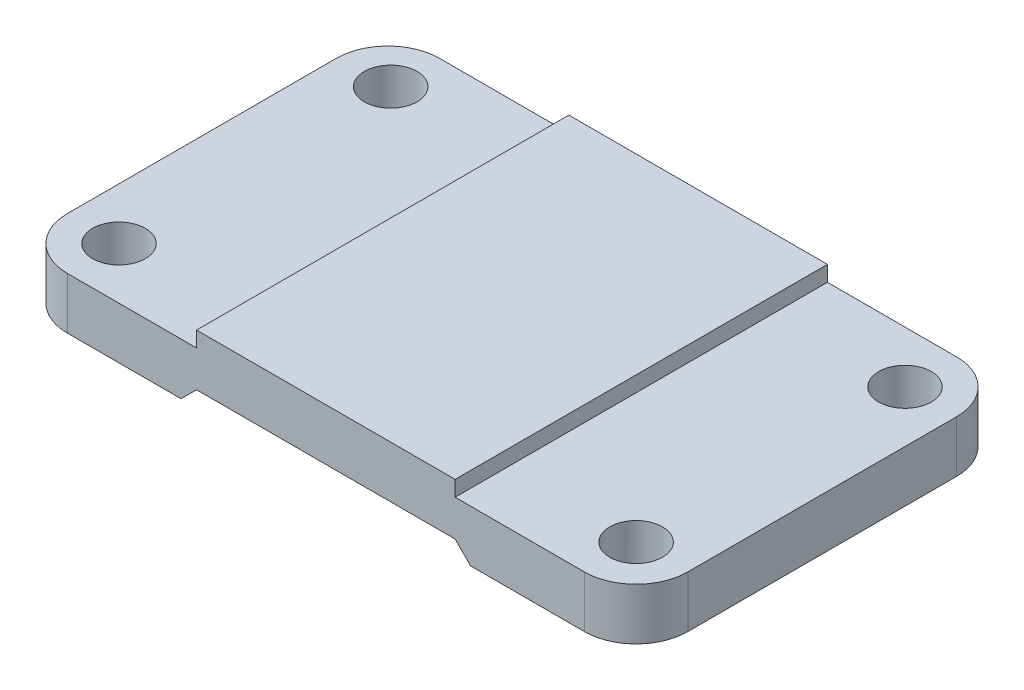
ISO-10303-21;
HEADER;
FILE_DESCRIPTION(('STEP AP214'),'2;1');
FILE_NAME('part.step','',(''),(''),'','','');
FILE_SCHEMA(('AUTOMOTIVE_DESIGN { 1 0 10303 214 1 1 1 1 }'));
ENDSEC;
DATA;
#1=APPLICATION_CONTEXT('core data for automotive mechanical design processes');
#2=APPLICATION_PROTOCOL_DEFINITION('international standard','automotive_design',2000,#1);
#3=PRODUCT_CONTEXT('',#1,'mechanical');
#4=PRODUCT('Part','Part','',(#3));
#5=PRODUCT_RELATED_PRODUCT_CATEGORY('part','',(#4));
#6=PRODUCT_DEFINITION_FORMATION('','',#4);
#7=PRODUCT_DEFINITION_CONTEXT('part definition',#1,'design');
#8=PRODUCT_DEFINITION('design','',#6,#7);
#9=PRODUCT_DEFINITION_SHAPE('','',#8);
#10=(LENGTH_UNIT() NAMED_UNIT(*) SI_UNIT(.MILLI.,.METRE.));
#11=(NAMED_UNIT(*) PLANE_ANGLE_UNIT() SI_UNIT($,.RADIAN.));
#12=(NAMED_UNIT(*) SI_UNIT($,.STERADIAN.) SOLID_ANGLE_UNIT());
#13=UNCERTAINTY_MEASURE_WITH_UNIT(LENGTH_MEASURE(1.E-05),#10,'distance_accuracy_value','');
#14=(GEOMETRIC_REPRESENTATION_CONTEXT(3) GLOBAL_UNCERTAINTY_ASSIGNED_CONTEXT((#13)) GLOBAL_UNIT_ASSIGNED_CONTEXT((#10,
#11,#12)) REPRESENTATION_CONTEXT('',''));
#15=CARTESIAN_POINT('',(0.,0.,0.));
#16=DIRECTION('',(0.,0.,1.));
#17=DIRECTION('',(1.,0.,0.));
#18=AXIS2_PLACEMENT_3D('',#15,#16,#17);
#19=CARTESIAN_POINT('',(0.,0.,0.));
#20=DIRECTION('',(0.,-1.,0.));
#21=DIRECTION('',(0.,0.,-1.));
#22=AXIS2_PLACEMENT_3D('',#19,#20,#21);
#23=PLANE('',#22);
#24=DIRECTION('',(0.,0.,1.));
#25=VECTOR('',#24,1.);
#26=CARTESIAN_POINT('',(-28.,0.,-36.));
#27=LINE('',#26,#25);
#28=CARTESIAN_POINT('',(-28.,0.,-36.));
#29=VERTEX_POINT('',#28);
#30=CARTESIAN_POINT('',(-28.,0.,36.));
#31=VERTEX_POINT('',#30);
#32=EDGE_CURVE('E195',#29,#31,#27,.T.);
#33=ORIENTED_EDGE('',*,*,#32,.T.);
#34=DIRECTION('',(1.,0.,0.));
#35=VECTOR('',#34,1.);
#36=CARTESIAN_POINT('',(-60.,0.,36.));
#37=LINE('',#36,#35);
#38=CARTESIAN_POINT('',(-50.,0.,36.));
#39=VERTEX_POINT('',#38);
#40=EDGE_CURVE('E276',#39,#31,#37,.T.);
#41=ORIENTED_EDGE('',*,*,#40,.F.);
#42=CARTESIAN_POINT('',(-50.,0.,26.));
#43=DIRECTION('',(0.,-1.,0.));
#44=DIRECTION('',(0.,0.,-1.));
#45=AXIS2_PLACEMENT_3D('',#42,#43,#44);
#46=CIRCLE('',#45,10.);
#47=CARTESIAN_POINT('',(-60.,0.,26.));
#48=VERTEX_POINT('',#47);
#49=EDGE_CURVE('E321',#39,#48,#46,.T.);
#50=ORIENTED_EDGE('',*,*,#49,.T.);
#51=DIRECTION('',(0.,0.,1.));
#52=VECTOR('',#51,1.);
#53=CARTESIAN_POINT('',(-60.,0.,36.));
#54=LINE('',#53,#52);
#55=CARTESIAN_POINT('',(-60.,0.,-26.));
#56=VERTEX_POINT('',#55);
#57=EDGE_CURVE('E295',#56,#48,#54,.T.);
#58=ORIENTED_EDGE('',*,*,#57,.F.);
#59=CARTESIAN_POINT('',(-50.,0.,-26.));
#60=DIRECTION('',(0.,-1.,0.));
#61=DIRECTION('',(0.,0.,-1.));
#62=AXIS2_PLACEMENT_3D('',#59,#60,#61);
#63=CIRCLE('',#62,10.);
#64=CARTESIAN_POINT('',(-50.,0.,-36.));
#65=VERTEX_POINT('',#64);
#66=EDGE_CURVE('E317',#56,#65,#63,.T.);
#67=ORIENTED_EDGE('',*,*,#66,.T.);
#68=DIRECTION('',(-1.,0.,0.));
#69=VECTOR('',#68,1.);
#70=CARTESIAN_POINT('',(-60.,0.,-36.));
#71=LINE('',#70,#69);
#72=EDGE_CURVE('E292',#29,#65,#71,.T.);
#73=ORIENTED_EDGE('',*,*,#72,.F.);
#74=EDGE_LOOP('',(#33,#41,#50,#58,#67,#73));
#75=FACE_BOUND('',#74,.T.);
#76=CARTESIAN_POINT('',(-50.,0.,26.));
#77=DIRECTION('',(0.,-1.,0.));
#78=DIRECTION('',(0.,0.,-1.));
#79=AXIS2_PLACEMENT_3D('',#76,#77,#78);
#80=CIRCLE('',#79,5.1);
#81=CARTESIAN_POINT('',(-50.,0.,20.9));
#82=VERTEX_POINT('',#81);
#83=EDGE_CURVE('E266',#82,#82,#80,.T.);
#84=ORIENTED_EDGE('',*,*,#83,.F.);
#85=EDGE_LOOP('',(#84));
#86=FACE_BOUND('',#85,.T.);
#87=CARTESIAN_POINT('',(-50.,0.,-26.5405080621177));
#88=DIRECTION('',(0.,-1.,0.));
#89=DIRECTION('',(0.,0.,-1.));
#90=AXIS2_PLACEMENT_3D('',#87,#88,#89);
#91=CIRCLE('',#90,5.1);
#92=CARTESIAN_POINT('',(-50.,0.,-31.6405080621177));
#93=VERTEX_POINT('',#92);
#94=EDGE_CURVE('E258',#93,#93,#91,.T.);
#95=ORIENTED_EDGE('',*,*,#94,.F.);
#96=EDGE_LOOP('',(#95));
#97=FACE_BOUND('',#96,.T.);
#98=ADVANCED_FACE('F45',(#75,#86,#97),#23,.T.);
#99=CARTESIAN_POINT('',(0.,10.,0.));
#100=DIRECTION('',(0.,-1.,0.));
#101=DIRECTION('',(0.,0.,-1.));
#102=AXIS2_PLACEMENT_3D('',#99,#100,#101);
#103=PLANE('',#102);
#104=CARTESIAN_POINT('',(50.,10.,26.));
#105=DIRECTION('',(0.,1.,0.));
#106=DIRECTION('',(0.,0.,1.));
#107=AXIS2_PLACEMENT_3D('',#104,#105,#106);
#108=CIRCLE('',#107,5.09999999999999);
#109=CARTESIAN_POINT('',(50.,10.,31.1));
#110=VERTEX_POINT('',#109);
#111=EDGE_CURVE('E238',#110,#110,#108,.T.);
#112=ORIENTED_EDGE('',*,*,#111,.F.);
#113=EDGE_LOOP('',(#112));
#114=FACE_BOUND('',#113,.T.);
#115=CARTESIAN_POINT('',(50.,10.,-26.));
#116=DIRECTION('',(0.,1.,0.));
#117=DIRECTION('',(0.,0.,1.));
#118=AXIS2_PLACEMENT_3D('',#115,#116,#117);
#119=CIRCLE('',#118,5.1);
#120=CARTESIAN_POINT('',(50.,10.,-20.9));
#121=VERTEX_POINT('',#120);
#122=EDGE_CURVE('E246',#121,#121,#119,.T.);
#123=ORIENTED_EDGE('',*,*,#122,.F.);
#124=EDGE_LOOP('',(#123));
#125=FACE_BOUND('',#124,.T.);
#126=DIRECTION('',(0.,0.,-1.));
#127=VECTOR('',#126,1.);
#128=CARTESIAN_POINT('',(25.,10.,36.));
#129=LINE('',#128,#127);
#130=CARTESIAN_POINT('',(25.,10.,36.));
#131=VERTEX_POINT('',#130);
#132=CARTESIAN_POINT('',(25.,10.,-36.));
#133=VERTEX_POINT('',#132);
#134=EDGE_CURVE('E199',#131,#133,#129,.T.);
#135=ORIENTED_EDGE('',*,*,#134,.F.);
#136=DIRECTION('',(1.,0.,0.));
#137=VECTOR('',#136,1.);
#138=CARTESIAN_POINT('',(-60.,10.,36.));
#139=LINE('',#138,#137);
#140=CARTESIAN_POINT('',(50.,10.,36.));
#141=VERTEX_POINT('',#140);
#142=EDGE_CURVE('E284',#131,#141,#139,.T.);
#143=ORIENTED_EDGE('',*,*,#142,.T.);
#144=CARTESIAN_POINT('',(50.,10.,26.));
#145=DIRECTION('',(0.,-1.,0.));
#146=DIRECTION('',(0.,0.,-1.));
#147=AXIS2_PLACEMENT_3D('',#144,#145,#146);
#148=CIRCLE('',#147,10.);
#149=CARTESIAN_POINT('',(60.,10.,26.));
#150=VERTEX_POINT('',#149);
#151=EDGE_CURVE('E331',#141,#150,#148,.F.);
#152=ORIENTED_EDGE('',*,*,#151,.T.);
#153=DIRECTION('',(0.,0.,-1.));
#154=VECTOR('',#153,1.);
#155=CARTESIAN_POINT('',(60.,10.,36.));
#156=LINE('',#155,#154);
#157=CARTESIAN_POINT('',(60.,10.,-26.));
#158=VERTEX_POINT('',#157);
#159=EDGE_CURVE('E271',#150,#158,#156,.T.);
#160=ORIENTED_EDGE('',*,*,#159,.T.);
#161=CARTESIAN_POINT('',(50.,10.,-26.));
#162=DIRECTION('',(0.,-1.,0.));
#163=DIRECTION('',(0.,0.,-1.));
#164=AXIS2_PLACEMENT_3D('',#161,#162,#163);
#165=CIRCLE('',#164,10.);
#166=CARTESIAN_POINT('',(50.,10.,-36.));
#167=VERTEX_POINT('',#166);
#168=EDGE_CURVE('E334',#158,#167,#165,.F.);
#169=ORIENTED_EDGE('',*,*,#168,.T.);
#170=DIRECTION('',(-1.,0.,0.));
#171=VECTOR('',#170,1.);
#172=CARTESIAN_POINT('',(-60.,10.,-36.));
#173=LINE('',#172,#171);
#174=EDGE_CURVE('E277',#167,#133,#173,.T.);
#175=ORIENTED_EDGE('',*,*,#174,.T.);
#176=EDGE_LOOP('',(#135,#143,#152,#160,#169,#175));
#177=FACE_BOUND('',#176,.T.);
#178=ADVANCED_FACE('F371',(#114,#125,#177),#103,.F.);
#179=CARTESIAN_POINT('',(-50.,10.,26.));
#180=DIRECTION('',(0.,1.,0.));
#181=DIRECTION('',(0.,0.,1.));
#182=AXIS2_PLACEMENT_3D('',#179,#180,#181);
#183=CIRCLE('',#182,5.09999999999999);
#184=CARTESIAN_POINT('',(-50.,10.,31.1));
#185=VERTEX_POINT('',#184);
#186=EDGE_CURVE('E262',#185,#185,#183,.T.);
#187=ORIENTED_EDGE('',*,*,#186,.F.);
#188=EDGE_LOOP('',(#187));
#189=FACE_BOUND('',#188,.T.);
#190=CARTESIAN_POINT('',(-50.,10.,-26.5405080621177));
#191=DIRECTION('',(0.,1.,0.));
#192=DIRECTION('',(0.,0.,1.));
#193=AXIS2_PLACEMENT_3D('',#190,#191,#192);
#194=CIRCLE('',#193,5.1);
#195=CARTESIAN_POINT('',(-50.,10.,-21.4405080621177));
#196=VERTEX_POINT('',#195);
#197=EDGE_CURVE('E254',#196,#196,#194,.T.);
#198=ORIENTED_EDGE('',*,*,#197,.F.);
#199=EDGE_LOOP('',(#198));
#200=FACE_BOUND('',#199,.T.);
#201=DIRECTION('',(0.,0.,1.));
#202=VECTOR('',#201,1.);
#203=CARTESIAN_POINT('',(-25.,10.,36.));
#204=LINE('',#203,#202);
#205=CARTESIAN_POINT('',(-25.,10.,-36.));
#206=VERTEX_POINT('',#205);
#207=CARTESIAN_POINT('',(-25.,10.,36.));
#208=VERTEX_POINT('',#207);
#209=EDGE_CURVE('E69',#206,#208,#204,.T.);
#210=ORIENTED_EDGE('',*,*,#209,.F.);
#211=CARTESIAN_POINT('',(-50.,10.,-36.));
#212=VERTEX_POINT('',#211);
#213=EDGE_CURVE('E275',#206,#212,#173,.T.);
#214=ORIENTED_EDGE('',*,*,#213,.T.);
#215=CARTESIAN_POINT('',(-50.,10.,-26.));
#216=DIRECTION('',(0.,-1.,0.));
#217=DIRECTION('',(0.,0.,-1.));
#218=AXIS2_PLACEMENT_3D('',#215,#216,#217);
#219=CIRCLE('',#218,10.);
#220=CARTESIAN_POINT('',(-60.,10.,-26.));
#221=VERTEX_POINT('',#220);
#222=EDGE_CURVE('E337',#212,#221,#219,.F.);
#223=ORIENTED_EDGE('',*,*,#222,.T.);
#224=DIRECTION('',(0.,0.,1.));
#225=VECTOR('',#224,1.);
#226=CARTESIAN_POINT('',(-60.,10.,36.));
#227=LINE('',#226,#225);
#228=CARTESIAN_POINT('',(-60.,10.,26.));
#229=VERTEX_POINT('',#228);
#230=EDGE_CURVE('E280',#221,#229,#227,.T.);
#231=ORIENTED_EDGE('',*,*,#230,.T.);
#232=CARTESIAN_POINT('',(-50.,10.,26.));
#233=DIRECTION('',(0.,-1.,0.));
#234=DIRECTION('',(0.,0.,-1.));
#235=AXIS2_PLACEMENT_3D('',#232,#233,#234);
#236=CIRCLE('',#235,10.);
#237=CARTESIAN_POINT('',(-50.,10.,36.));
#238=VERTEX_POINT('',#237);
#239=EDGE_CURVE('E340',#229,#238,#236,.F.);
#240=ORIENTED_EDGE('',*,*,#239,.T.);
#241=EDGE_CURVE('E285',#238,#208,#139,.T.);
#242=ORIENTED_EDGE('',*,*,#241,.T.);
#243=EDGE_LOOP('',(#210,#214,#223,#231,#240,#242));
#244=FACE_BOUND('',#243,.T.);
#245=ADVANCED_FACE('F388',(#189,#200,#244),#103,.F.);
#246=CARTESIAN_POINT('',(60.,10.,36.));
#247=DIRECTION('',(-1.,0.,0.));
#248=DIRECTION('',(0.,0.,1.));
#249=AXIS2_PLACEMENT_3D('',#246,#247,#248);
#250=PLANE('',#249);
#251=DIRECTION('',(0.,0.,-1.));
#252=VECTOR('',#251,1.);
#253=CARTESIAN_POINT('',(60.,0.,36.));
#254=LINE('',#253,#252);
#255=CARTESIAN_POINT('',(60.,0.,26.));
#256=VERTEX_POINT('',#255);
#257=CARTESIAN_POINT('',(60.,0.,-26.));
#258=VERTEX_POINT('',#257);
#259=EDGE_CURVE('E270',#256,#258,#254,.T.);
#260=ORIENTED_EDGE('',*,*,#259,.T.);
#261=DIRECTION('',(0.,-1.,0.));
#262=VECTOR('',#261,1.);
#263=CARTESIAN_POINT('',(60.,10.,-26.));
#264=LINE('',#263,#262);
#265=EDGE_CURVE('E11',#258,#158,#264,.F.);
#266=ORIENTED_EDGE('',*,*,#265,.T.);
#267=ORIENTED_EDGE('',*,*,#159,.F.);
#268=DIRECTION('',(0.,-1.,0.));
#269=VECTOR('',#268,1.);
#270=CARTESIAN_POINT('',(60.,10.,26.));
#271=LINE('',#270,#269);
#272=EDGE_CURVE('E54',#150,#256,#271,.T.);
#273=ORIENTED_EDGE('',*,*,#272,.T.);
#274=EDGE_LOOP('',(#260,#266,#267,#273));
#275=FACE_BOUND('',#274,.T.);
#276=ADVANCED_FACE('F355',(#275),#250,.F.);
#277=CARTESIAN_POINT('',(-60.,10.,-36.));
#278=DIRECTION('',(0.,0.,1.));
#279=DIRECTION('',(1.,0.,0.));
#280=AXIS2_PLACEMENT_3D('',#277,#278,#279);
#281=PLANE('',#280);
#282=DIRECTION('',(-1.,0.,0.));
#283=VECTOR('',#282,1.);
#284=CARTESIAN_POINT('',(-25.,3.,-36.));
#285=LINE('',#284,#283);
#286=CARTESIAN_POINT('',(25.,3.00000000000001,-36.));
#287=VERTEX_POINT('',#286);
#288=CARTESIAN_POINT('',(-25.,3.,-36.));
#289=VERTEX_POINT('',#288);
#290=EDGE_CURVE('E169',#287,#289,#285,.T.);
#291=ORIENTED_EDGE('',*,*,#290,.T.);
#292=DIRECTION('',(-0.707106781186546,-0.707106781186549,0.));
#293=VECTOR('',#292,1.);
#294=CARTESIAN_POINT('',(-28.,0.,-36.));
#295=LINE('',#294,#293);
#296=EDGE_CURVE('E175',#289,#29,#295,.T.);
#297=ORIENTED_EDGE('',*,*,#296,.T.);
#298=ORIENTED_EDGE('',*,*,#72,.T.);
#299=DIRECTION('',(0.,-1.,0.));
#300=VECTOR('',#299,1.);
#301=CARTESIAN_POINT('',(-50.,10.,-36.));
#302=LINE('',#301,#300);
#303=EDGE_CURVE('E346',#65,#212,#302,.F.);
#304=ORIENTED_EDGE('',*,*,#303,.T.);
#305=ORIENTED_EDGE('',*,*,#213,.F.);
#306=DIRECTION('',(0.,-1.,0.));
#307=VECTOR('',#306,1.);
#308=CARTESIAN_POINT('',(-25.,13.,-36.));
#309=LINE('',#308,#307);
#310=CARTESIAN_POINT('',(-25.,13.,-36.));
#311=VERTEX_POINT('',#310);
#312=EDGE_CURVE('E230',#311,#206,#309,.T.);
#313=ORIENTED_EDGE('',*,*,#312,.F.);
#314=DIRECTION('',(-1.,0.,0.));
#315=VECTOR('',#314,1.);
#316=CARTESIAN_POINT('',(-25.,13.,-36.));
#317=LINE('',#316,#315);
#318=CARTESIAN_POINT('',(25.,13.,-36.));
#319=VERTEX_POINT('',#318);
#320=EDGE_CURVE('E208',#319,#311,#317,.T.);
#321=ORIENTED_EDGE('',*,*,#320,.F.);
#322=DIRECTION('',(0.,-1.,0.));
#323=VECTOR('',#322,1.);
#324=CARTESIAN_POINT('',(25.,13.,-36.));
#325=LINE('',#324,#323);
#326=EDGE_CURVE('E234',#319,#133,#325,.T.);
#327=ORIENTED_EDGE('',*,*,#326,.T.);
#328=ORIENTED_EDGE('',*,*,#174,.F.);
#329=DIRECTION('',(0.,-1.,0.));
#330=VECTOR('',#329,1.);
#331=CARTESIAN_POINT('',(50.,10.,-36.));
#332=LINE('',#331,#330);
#333=CARTESIAN_POINT('',(50.,0.,-36.));
#334=VERTEX_POINT('',#333);
#335=EDGE_CURVE('E343',#167,#334,#332,.T.);
#336=ORIENTED_EDGE('',*,*,#335,.T.);
#337=CARTESIAN_POINT('',(28.,0.,-36.));
#338=VERTEX_POINT('',#337);
#339=EDGE_CURVE('E181',#334,#338,#71,.T.);
#340=ORIENTED_EDGE('',*,*,#339,.T.);
#341=DIRECTION('',(-0.707106781186546,0.707106781186549,0.));
#342=VECTOR('',#341,1.);
#343=CARTESIAN_POINT('',(25.,3.00000000000001,-36.));
#344=LINE('',#343,#342);
#345=EDGE_CURVE('E61',#338,#287,#344,.T.);
#346=ORIENTED_EDGE('',*,*,#345,.T.);
#347=EDGE_LOOP('',(#291,#297,#298,#304,#305,#313,#321,#327,#328,#336,#340,#346));
#348=FACE_BOUND('',#347,.T.);
#349=ADVANCED_FACE('F178',(#348),#281,.F.);
#350=CARTESIAN_POINT('',(-60.,10.,36.));
#351=DIRECTION('',(1.,0.,0.));
#352=DIRECTION('',(0.,0.,-1.));
#353=AXIS2_PLACEMENT_3D('',#350,#351,#352);
#354=PLANE('',#353);
#355=ORIENTED_EDGE('',*,*,#57,.T.);
#356=DIRECTION('',(0.,-1.,0.));
#357=VECTOR('',#356,1.);
#358=CARTESIAN_POINT('',(-60.,10.,26.));
#359=LINE('',#358,#357);
#360=EDGE_CURVE('E328',#48,#229,#359,.F.);
#361=ORIENTED_EDGE('',*,*,#360,.T.);
#362=ORIENTED_EDGE('',*,*,#230,.F.);
#363=DIRECTION('',(0.,-1.,0.));
#364=VECTOR('',#363,1.);
#365=CARTESIAN_POINT('',(-60.,10.,-26.));
#366=LINE('',#365,#364);
#367=EDGE_CURVE('E324',#221,#56,#366,.T.);
#368=ORIENTED_EDGE('',*,*,#367,.T.);
#369=EDGE_LOOP('',(#355,#361,#362,#368));
#370=FACE_BOUND('',#369,.T.);
#371=ADVANCED_FACE('F391',(#370),#354,.F.);
#372=CARTESIAN_POINT('',(-60.,10.,36.));
#373=DIRECTION('',(0.,0.,-1.));
#374=DIRECTION('',(-1.,0.,0.));
#375=AXIS2_PLACEMENT_3D('',#372,#373,#374);
#376=PLANE('',#375);
#377=ORIENTED_EDGE('',*,*,#40,.T.);
#378=DIRECTION('',(-0.707106781186546,-0.707106781186549,0.));
#379=VECTOR('',#378,1.);
#380=CARTESIAN_POINT('',(-28.,0.,36.));
#381=LINE('',#380,#379);
#382=CARTESIAN_POINT('',(-25.,3.,36.));
#383=VERTEX_POINT('',#382);
#384=EDGE_CURVE('E183',#383,#31,#381,.T.);
#385=ORIENTED_EDGE('',*,*,#384,.F.);
#386=DIRECTION('',(-1.,0.,0.));
#387=VECTOR('',#386,1.);
#388=CARTESIAN_POINT('',(-25.,3.,36.));
#389=LINE('',#388,#387);
#390=CARTESIAN_POINT('',(25.,3.00000000000001,36.));
#391=VERTEX_POINT('',#390);
#392=EDGE_CURVE('E186',#391,#383,#389,.T.);
#393=ORIENTED_EDGE('',*,*,#392,.F.);
#394=DIRECTION('',(-0.707106781186546,0.707106781186549,0.));
#395=VECTOR('',#394,1.);
#396=CARTESIAN_POINT('',(25.,3.00000000000001,36.));
#397=LINE('',#396,#395);
#398=CARTESIAN_POINT('',(28.,0.,36.));
#399=VERTEX_POINT('',#398);
#400=EDGE_CURVE('E160',#399,#391,#397,.T.);
#401=ORIENTED_EDGE('',*,*,#400,.F.);
#402=CARTESIAN_POINT('',(50.,0.,36.));
#403=VERTEX_POINT('',#402);
#404=EDGE_CURVE('E299',#399,#403,#37,.T.);
#405=ORIENTED_EDGE('',*,*,#404,.T.);
#406=DIRECTION('',(0.,-1.,0.));
#407=VECTOR('',#406,1.);
#408=CARTESIAN_POINT('',(50.,10.,36.));
#409=LINE('',#408,#407);
#410=EDGE_CURVE('E288',#403,#141,#409,.F.);
#411=ORIENTED_EDGE('',*,*,#410,.T.);
#412=ORIENTED_EDGE('',*,*,#142,.F.);
#413=DIRECTION('',(0.,-1.,0.));
#414=VECTOR('',#413,1.);
#415=CARTESIAN_POINT('',(25.,13.,36.));
#416=LINE('',#415,#414);
#417=CARTESIAN_POINT('',(25.,13.,36.));
#418=VERTEX_POINT('',#417);
#419=EDGE_CURVE('E217',#418,#131,#416,.T.);
#420=ORIENTED_EDGE('',*,*,#419,.F.);
#421=DIRECTION('',(1.,0.,0.));
#422=VECTOR('',#421,1.);
#423=CARTESIAN_POINT('',(-25.,13.,36.));
#424=LINE('',#423,#422);
#425=CARTESIAN_POINT('',(-25.,13.,36.));
#426=VERTEX_POINT('',#425);
#427=EDGE_CURVE('E214',#426,#418,#424,.T.);
#428=ORIENTED_EDGE('',*,*,#427,.F.);
#429=DIRECTION('',(0.,-1.,0.));
#430=VECTOR('',#429,1.);
#431=CARTESIAN_POINT('',(-25.,13.,36.));
#432=LINE('',#431,#430);
#433=EDGE_CURVE('E226',#426,#208,#432,.T.);
#434=ORIENTED_EDGE('',*,*,#433,.T.);
#435=ORIENTED_EDGE('',*,*,#241,.F.);
#436=DIRECTION('',(0.,-1.,0.));
#437=VECTOR('',#436,1.);
#438=CARTESIAN_POINT('',(-50.,10.,36.));
#439=LINE('',#438,#437);
#440=EDGE_CURVE('E306',#238,#39,#439,.T.);
#441=ORIENTED_EDGE('',*,*,#440,.T.);
#442=EDGE_LOOP('',(#377,#385,#393,#401,#405,#411,#412,#420,#428,#434,#435,#441));
#443=FACE_BOUND('',#442,.T.);
#444=ADVANCED_FACE('F374',(#443),#376,.F.);
#445=DIRECTION('',(0.,0.,1.));
#446=VECTOR('',#445,1.);
#447=CARTESIAN_POINT('',(28.,0.,-36.));
#448=LINE('',#447,#446);
#449=EDGE_CURVE('E166',#338,#399,#448,.T.);
#450=ORIENTED_EDGE('',*,*,#449,.F.);
#451=ORIENTED_EDGE('',*,*,#339,.F.);
#452=CARTESIAN_POINT('',(50.,0.,-26.));
#453=DIRECTION('',(0.,-1.,0.));
#454=DIRECTION('',(0.,0.,-1.));
#455=AXIS2_PLACEMENT_3D('',#452,#453,#454);
#456=CIRCLE('',#455,10.);
#457=EDGE_CURVE('E314',#334,#258,#456,.T.);
#458=ORIENTED_EDGE('',*,*,#457,.T.);
#459=ORIENTED_EDGE('',*,*,#259,.F.);
#460=CARTESIAN_POINT('',(50.,0.,26.));
#461=DIRECTION('',(0.,-1.,0.));
#462=DIRECTION('',(0.,0.,-1.));
#463=AXIS2_PLACEMENT_3D('',#460,#461,#462);
#464=CIRCLE('',#463,10.);
#465=EDGE_CURVE('E310',#256,#403,#464,.T.);
#466=ORIENTED_EDGE('',*,*,#465,.T.);
#467=ORIENTED_EDGE('',*,*,#404,.F.);
#468=EDGE_LOOP('',(#450,#451,#458,#459,#466,#467));
#469=FACE_BOUND('',#468,.T.);
#470=CARTESIAN_POINT('',(50.,0.,26.));
#471=DIRECTION('',(0.,-1.,0.));
#472=DIRECTION('',(0.,0.,-1.));
#473=AXIS2_PLACEMENT_3D('',#470,#471,#472);
#474=CIRCLE('',#473,5.1);
#475=CARTESIAN_POINT('',(50.,0.,20.9));
#476=VERTEX_POINT('',#475);
#477=EDGE_CURVE('E242',#476,#476,#474,.T.);
#478=ORIENTED_EDGE('',*,*,#477,.F.);
#479=EDGE_LOOP('',(#478));
#480=FACE_BOUND('',#479,.T.);
#481=CARTESIAN_POINT('',(50.,0.,-26.));
#482=DIRECTION('',(0.,-1.,0.));
#483=DIRECTION('',(0.,0.,-1.));
#484=AXIS2_PLACEMENT_3D('',#481,#482,#483);
#485=CIRCLE('',#484,5.1);
#486=CARTESIAN_POINT('',(50.,0.,-31.1));
#487=VERTEX_POINT('',#486);
#488=EDGE_CURVE('E250',#487,#487,#485,.T.);
#489=ORIENTED_EDGE('',*,*,#488,.F.);
#490=EDGE_LOOP('',(#489));
#491=FACE_BOUND('',#490,.T.);
#492=ADVANCED_FACE('F360',(#469,#480,#491),#23,.T.);
#493=CARTESIAN_POINT('',(-50.,10.,26.));
#494=DIRECTION('',(0.,-1.,0.));
#495=DIRECTION('',(0.,0.,-1.));
#496=AXIS2_PLACEMENT_3D('',#493,#494,#495);
#497=CYLINDRICAL_SURFACE('',#496,10.);
#498=ORIENTED_EDGE('',*,*,#239,.F.);
#499=ORIENTED_EDGE('',*,*,#360,.F.);
#500=ORIENTED_EDGE('',*,*,#49,.F.);
#501=ORIENTED_EDGE('',*,*,#440,.F.);
#502=EDGE_LOOP('',(#498,#499,#500,#501));
#503=FACE_BOUND('',#502,.T.);
#504=ADVANCED_FACE('F394',(#503),#497,.T.);
#505=CARTESIAN_POINT('',(-50.,10.,-26.));
#506=DIRECTION('',(0.,-1.,0.));
#507=DIRECTION('',(0.,0.,-1.));
#508=AXIS2_PLACEMENT_3D('',#505,#506,#507);
#509=CYLINDRICAL_SURFACE('',#508,10.);
#510=ORIENTED_EDGE('',*,*,#222,.F.);
#511=ORIENTED_EDGE('',*,*,#303,.F.);
#512=ORIENTED_EDGE('',*,*,#66,.F.);
#513=ORIENTED_EDGE('',*,*,#367,.F.);
#514=EDGE_LOOP('',(#510,#511,#512,#513));
#515=FACE_BOUND('',#514,.T.);
#516=ADVANCED_FACE('F386',(#515),#509,.T.);
#517=CARTESIAN_POINT('',(50.,10.,-26.));
#518=DIRECTION('',(0.,-1.,0.));
#519=DIRECTION('',(0.,0.,-1.));
#520=AXIS2_PLACEMENT_3D('',#517,#518,#519);
#521=CYLINDRICAL_SURFACE('',#520,10.);
#522=ORIENTED_EDGE('',*,*,#168,.F.);
#523=ORIENTED_EDGE('',*,*,#265,.F.);
#524=ORIENTED_EDGE('',*,*,#457,.F.);
#525=ORIENTED_EDGE('',*,*,#335,.F.);
#526=EDGE_LOOP('',(#522,#523,#524,#525));
#527=FACE_BOUND('',#526,.T.);
#528=ADVANCED_FACE('F367',(#527),#521,.T.);
#529=CARTESIAN_POINT('',(50.,10.,26.));
#530=DIRECTION('',(0.,-1.,0.));
#531=DIRECTION('',(0.,0.,-1.));
#532=AXIS2_PLACEMENT_3D('',#529,#530,#531);
#533=CYLINDRICAL_SURFACE('',#532,10.);
#534=ORIENTED_EDGE('',*,*,#151,.F.);
#535=ORIENTED_EDGE('',*,*,#410,.F.);
#536=ORIENTED_EDGE('',*,*,#465,.F.);
#537=ORIENTED_EDGE('',*,*,#272,.F.);
#538=EDGE_LOOP('',(#534,#535,#536,#537));
#539=FACE_BOUND('',#538,.T.);
#540=ADVANCED_FACE('F47',(#539),#533,.T.);
#541=CARTESIAN_POINT('',(-50.,10.,26.));
#542=DIRECTION('',(0.,1.,0.));
#543=DIRECTION('',(0.,0.,1.));
#544=AXIS2_PLACEMENT_3D('',#541,#542,#543);
#545=CYLINDRICAL_SURFACE('',#544,5.1);
#546=ORIENTED_EDGE('',*,*,#186,.T.);
#547=EDGE_LOOP('',(#546));
#548=FACE_BOUND('',#547,.T.);
#549=ORIENTED_EDGE('',*,*,#83,.T.);
#550=EDGE_LOOP('',(#549));
#551=FACE_BOUND('',#550,.T.);
#552=ADVANCED_FACE('F450',(#548,#551),#545,.F.);
#553=CARTESIAN_POINT('',(-50.,10.,-26.5405080621177));
#554=DIRECTION('',(0.,1.,0.));
#555=DIRECTION('',(0.,0.,1.));
#556=AXIS2_PLACEMENT_3D('',#553,#554,#555);
#557=CYLINDRICAL_SURFACE('',#556,5.1);
#558=ORIENTED_EDGE('',*,*,#197,.T.);
#559=EDGE_LOOP('',(#558));
#560=FACE_BOUND('',#559,.T.);
#561=ORIENTED_EDGE('',*,*,#94,.T.);
#562=EDGE_LOOP('',(#561));
#563=FACE_BOUND('',#562,.T.);
#564=ADVANCED_FACE('F454',(#560,#563),#557,.F.);
#565=CARTESIAN_POINT('',(50.,10.,-26.));
#566=DIRECTION('',(0.,1.,0.));
#567=DIRECTION('',(0.,0.,1.));
#568=AXIS2_PLACEMENT_3D('',#565,#566,#567);
#569=CYLINDRICAL_SURFACE('',#568,5.1);
#570=ORIENTED_EDGE('',*,*,#122,.T.);
#571=EDGE_LOOP('',(#570));
#572=FACE_BOUND('',#571,.T.);
#573=ORIENTED_EDGE('',*,*,#488,.T.);
#574=EDGE_LOOP('',(#573));
#575=FACE_BOUND('',#574,.T.);
#576=ADVANCED_FACE('F419',(#572,#575),#569,.F.);
#577=CARTESIAN_POINT('',(50.,10.,26.));
#578=DIRECTION('',(0.,1.,0.));
#579=DIRECTION('',(0.,0.,1.));
#580=AXIS2_PLACEMENT_3D('',#577,#578,#579);
#581=CYLINDRICAL_SURFACE('',#580,5.1);
#582=ORIENTED_EDGE('',*,*,#111,.T.);
#583=EDGE_LOOP('',(#582));
#584=FACE_BOUND('',#583,.T.);
#585=ORIENTED_EDGE('',*,*,#477,.T.);
#586=EDGE_LOOP('',(#585));
#587=FACE_BOUND('',#586,.T.);
#588=ADVANCED_FACE('F412',(#584,#587),#581,.F.);
#589=CARTESIAN_POINT('',(25.,13.,36.));
#590=DIRECTION('',(-1.,0.,0.));
#591=DIRECTION('',(0.,0.,1.));
#592=AXIS2_PLACEMENT_3D('',#589,#590,#591);
#593=PLANE('',#592);
#594=ORIENTED_EDGE('',*,*,#134,.T.);
#595=ORIENTED_EDGE('',*,*,#326,.F.);
#596=DIRECTION('',(0.,0.,-1.));
#597=VECTOR('',#596,1.);
#598=CARTESIAN_POINT('',(25.,13.,36.));
#599=LINE('',#598,#597);
#600=EDGE_CURVE('E204',#418,#319,#599,.T.);
#601=ORIENTED_EDGE('',*,*,#600,.F.);
#602=ORIENTED_EDGE('',*,*,#419,.T.);
#603=EDGE_LOOP('',(#594,#595,#601,#602));
#604=FACE_BOUND('',#603,.T.);
#605=ADVANCED_FACE('F410',(#604),#593,.F.);
#606=CARTESIAN_POINT('',(-25.,13.,36.));
#607=DIRECTION('',(1.,0.,0.));
#608=DIRECTION('',(0.,0.,-1.));
#609=AXIS2_PLACEMENT_3D('',#606,#607,#608);
#610=PLANE('',#609);
#611=ORIENTED_EDGE('',*,*,#209,.T.);
#612=ORIENTED_EDGE('',*,*,#433,.F.);
#613=DIRECTION('',(0.,0.,1.));
#614=VECTOR('',#613,1.);
#615=CARTESIAN_POINT('',(-25.,13.,36.));
#616=LINE('',#615,#614);
#617=EDGE_CURVE('E211',#311,#426,#616,.T.);
#618=ORIENTED_EDGE('',*,*,#617,.F.);
#619=ORIENTED_EDGE('',*,*,#312,.T.);
#620=EDGE_LOOP('',(#611,#612,#618,#619));
#621=FACE_BOUND('',#620,.T.);
#622=ADVANCED_FACE('F402',(#621),#610,.F.);
#623=CARTESIAN_POINT('',(0.,13.,0.));
#624=DIRECTION('',(0.,-1.,0.));
#625=DIRECTION('',(0.,0.,-1.));
#626=AXIS2_PLACEMENT_3D('',#623,#624,#625);
#627=PLANE('',#626);
#628=ORIENTED_EDGE('',*,*,#600,.T.);
#629=ORIENTED_EDGE('',*,*,#320,.T.);
#630=ORIENTED_EDGE('',*,*,#617,.T.);
#631=ORIENTED_EDGE('',*,*,#427,.T.);
#632=EDGE_LOOP('',(#628,#629,#630,#631));
#633=FACE_BOUND('',#632,.T.);
#634=ADVANCED_FACE('F408',(#633),#627,.F.);
#635=CARTESIAN_POINT('',(-28.,0.,-36.));
#636=DIRECTION('',(-0.707106781186549,0.707106781186546,0.));
#637=DIRECTION('',(-0.707106781186546,-0.707106781186549,0.));
#638=AXIS2_PLACEMENT_3D('',#635,#636,#637);
#639=PLANE('',#638);
#640=ORIENTED_EDGE('',*,*,#384,.T.);
#641=ORIENTED_EDGE('',*,*,#32,.F.);
#642=ORIENTED_EDGE('',*,*,#296,.F.);
#643=DIRECTION('',(0.,0.,1.));
#644=VECTOR('',#643,1.);
#645=CARTESIAN_POINT('',(-25.,3.,-36.));
#646=LINE('',#645,#644);
#647=EDGE_CURVE('E165',#289,#383,#646,.T.);
#648=ORIENTED_EDGE('',*,*,#647,.T.);
#649=EDGE_LOOP('',(#640,#641,#642,#648));
#650=FACE_BOUND('',#649,.T.);
#651=ADVANCED_FACE('F609',(#650),#639,.F.);
#652=CARTESIAN_POINT('',(-25.,3.,-36.));
#653=DIRECTION('',(0.,1.,0.));
#654=DIRECTION('',(-1.,0.,0.));
#655=AXIS2_PLACEMENT_3D('',#652,#653,#654);
#656=PLANE('',#655);
#657=ORIENTED_EDGE('',*,*,#392,.T.);
#658=ORIENTED_EDGE('',*,*,#647,.F.);
#659=ORIENTED_EDGE('',*,*,#290,.F.);
#660=DIRECTION('',(0.,0.,1.));
#661=VECTOR('',#660,1.);
#662=CARTESIAN_POINT('',(25.,3.00000000000001,-36.));
#663=LINE('',#662,#661);
#664=EDGE_CURVE('E156',#287,#391,#663,.T.);
#665=ORIENTED_EDGE('',*,*,#664,.T.);
#666=EDGE_LOOP('',(#657,#658,#659,#665));
#667=FACE_BOUND('',#666,.T.);
#668=ADVANCED_FACE('F170',(#667),#656,.F.);
#669=CARTESIAN_POINT('',(25.,3.00000000000001,-36.));
#670=DIRECTION('',(0.707106781186549,0.707106781186546,0.));
#671=DIRECTION('',(-0.707106781186546,0.707106781186549,0.));
#672=AXIS2_PLACEMENT_3D('',#669,#670,#671);
#673=PLANE('',#672);
#674=ORIENTED_EDGE('',*,*,#400,.T.);
#675=ORIENTED_EDGE('',*,*,#664,.F.);
#676=ORIENTED_EDGE('',*,*,#345,.F.);
#677=ORIENTED_EDGE('',*,*,#449,.T.);
#678=EDGE_LOOP('',(#674,#675,#676,#677));
#679=FACE_BOUND('',#678,.T.);
#680=ADVANCED_FACE('F158',(#679),#673,.F.);
#681=CLOSED_SHELL('',(#98,#178,#245,#276,#349,#371,#444,#492,#504,#516,#528,#540,#552,#564,#576,
#588,#605,#622,#634,#651,#668,#680));
#682=MANIFOLD_SOLID_BREP('B2',#681);
#683=ADVANCED_BREP_SHAPE_REPRESENTATION('',(#18,#682),#14);
#684=SHAPE_DEFINITION_REPRESENTATION(#9,#683);
ENDSEC;
END-ISO-10303-21;
